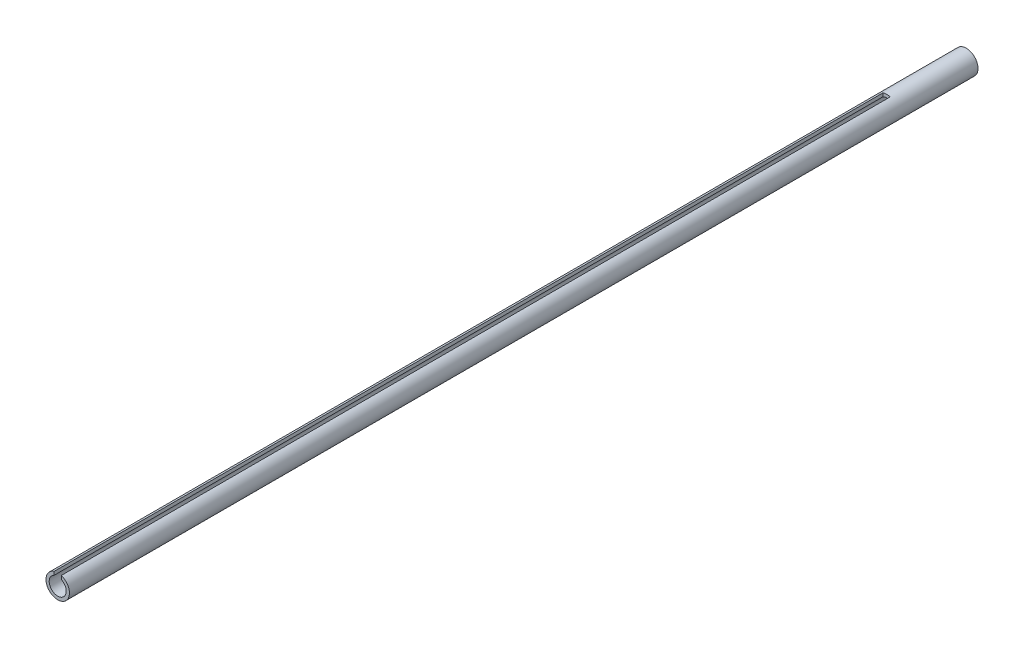
ISO-10303-21;
HEADER;
FILE_DESCRIPTION(('STEP AP214'),'2;1');
FILE_NAME('part.step','',(''),(''),'','','');
FILE_SCHEMA(('AUTOMOTIVE_DESIGN { 1 0 10303 214 1 1 1 1 }'));
ENDSEC;
DATA;
#1=APPLICATION_CONTEXT('core data for automotive mechanical design processes');
#2=APPLICATION_PROTOCOL_DEFINITION('international standard','automotive_design',2000,#1);
#3=PRODUCT_CONTEXT('',#1,'mechanical');
#4=PRODUCT('Part','Part','',(#3));
#5=PRODUCT_RELATED_PRODUCT_CATEGORY('part','',(#4));
#6=PRODUCT_DEFINITION_FORMATION('','',#4);
#7=PRODUCT_DEFINITION_CONTEXT('part definition',#1,'design');
#8=PRODUCT_DEFINITION('design','',#6,#7);
#9=PRODUCT_DEFINITION_SHAPE('','',#8);
#10=(LENGTH_UNIT() NAMED_UNIT(*) SI_UNIT(.MILLI.,.METRE.));
#11=(NAMED_UNIT(*) PLANE_ANGLE_UNIT() SI_UNIT($,.RADIAN.));
#12=(NAMED_UNIT(*) SI_UNIT($,.STERADIAN.) SOLID_ANGLE_UNIT());
#13=UNCERTAINTY_MEASURE_WITH_UNIT(LENGTH_MEASURE(1.E-05),#10,'distance_accuracy_value','');
#14=(GEOMETRIC_REPRESENTATION_CONTEXT(3) GLOBAL_UNCERTAINTY_ASSIGNED_CONTEXT((#13)) GLOBAL_UNIT_ASSIGNED_CONTEXT((#10,
#11,#12)) REPRESENTATION_CONTEXT('',''));
#15=CARTESIAN_POINT('',(0.,0.,0.));
#16=DIRECTION('',(0.,0.,1.));
#17=DIRECTION('',(1.,0.,0.));
#18=AXIS2_PLACEMENT_3D('',#15,#16,#17);
#19=CARTESIAN_POINT('',(0.,0.,57.));
#20=DIRECTION('',(0.,0.,1.));
#21=DIRECTION('',(1.,0.,0.));
#22=AXIS2_PLACEMENT_3D('',#19,#20,#21);
#23=PLANE('',#22);
#24=CARTESIAN_POINT('',(0.,0.,57.));
#25=DIRECTION('',(0.,0.,1.));
#26=DIRECTION('',(1.,0.,0.));
#27=AXIS2_PLACEMENT_3D('',#24,#25,#26);
#28=CIRCLE('',#27,0.535);
#29=CARTESIAN_POINT('',(-0.225,0.485386443980464,57.));
#30=VERTEX_POINT('',#29);
#31=CARTESIAN_POINT('',(0.225,0.485386443980464,57.));
#32=VERTEX_POINT('',#31);
#33=EDGE_CURVE('E134',#30,#32,#28,.T.);
#34=ORIENTED_EDGE('',*,*,#33,.F.);
#35=DIRECTION('',(0.,1.,0.));
#36=VECTOR('',#35,1.);
#37=CARTESIAN_POINT('',(-0.225,0.,57.));
#38=LINE('',#37,#36);
#39=CARTESIAN_POINT('',(-0.225,0.699714227381436,57.));
#40=VERTEX_POINT('',#39);
#41=EDGE_CURVE('E128',#30,#40,#38,.T.);
#42=ORIENTED_EDGE('',*,*,#41,.T.);
#43=CARTESIAN_POINT('',(0.,0.,57.));
#44=DIRECTION('',(0.,0.,1.));
#45=DIRECTION('',(1.,0.,0.));
#46=AXIS2_PLACEMENT_3D('',#43,#44,#45);
#47=CIRCLE('',#46,0.735);
#48=CARTESIAN_POINT('',(0.225,0.699714227381436,57.));
#49=VERTEX_POINT('',#48);
#50=EDGE_CURVE('E140',#40,#49,#47,.T.);
#51=ORIENTED_EDGE('',*,*,#50,.T.);
#52=DIRECTION('',(0.,-1.,0.));
#53=VECTOR('',#52,1.);
#54=CARTESIAN_POINT('',(0.225,0.,57.));
#55=LINE('',#54,#53);
#56=EDGE_CURVE('E123',#49,#32,#55,.T.);
#57=ORIENTED_EDGE('',*,*,#56,.T.);
#58=EDGE_LOOP('',(#34,#42,#51,#57));
#59=FACE_BOUND('',#58,.T.);
#60=ADVANCED_FACE('F32',(#59),#23,.T.);
#61=CARTESIAN_POINT('',(0.,0.,57.));
#62=DIRECTION('',(0.,0.,-1.));
#63=DIRECTION('',(-1.,0.,0.));
#64=AXIS2_PLACEMENT_3D('',#61,#62,#63);
#65=CYLINDRICAL_SURFACE('',#64,0.735);
#66=DIRECTION('',(0.,0.,-1.));
#67=VECTOR('',#66,1.);
#68=CARTESIAN_POINT('',(-0.500000000000123,-0.538725347463693,57.));
#69=LINE('',#68,#67);
#70=CARTESIAN_POINT('',(-0.5,-0.538725347463807,21.));
#71=VERTEX_POINT('',#70);
#72=CARTESIAN_POINT('',(-0.500000000000007,-0.538725347463801,23.));
#73=VERTEX_POINT('',#72);
#74=EDGE_CURVE('E105',#71,#73,#69,.F.);
#75=ORIENTED_EDGE('',*,*,#74,.T.);
#76=CARTESIAN_POINT('',(0.,0.,23.));
#77=DIRECTION('',(0.,0.,1.));
#78=DIRECTION('',(1.,0.,0.));
#79=AXIS2_PLACEMENT_3D('',#76,#77,#78);
#80=CIRCLE('',#79,0.735);
#81=CARTESIAN_POINT('',(0.5,-0.538725347463807,23.));
#82=VERTEX_POINT('',#81);
#83=EDGE_CURVE('E47',#73,#82,#80,.T.);
#84=ORIENTED_EDGE('',*,*,#83,.T.);
#85=DIRECTION('',(0.,0.,-1.));
#86=VECTOR('',#85,1.);
#87=CARTESIAN_POINT('',(0.500000000000006,-0.538725347463802,57.));
#88=LINE('',#87,#86);
#89=CARTESIAN_POINT('',(0.5,-0.538725347463802,21.));
#90=VERTEX_POINT('',#89);
#91=EDGE_CURVE('E98',#82,#90,#88,.T.);
#92=ORIENTED_EDGE('',*,*,#91,.T.);
#93=CARTESIAN_POINT('',(0.,0.,21.));
#94=DIRECTION('',(0.,0.,-1.));
#95=DIRECTION('',(-1.,0.,0.));
#96=AXIS2_PLACEMENT_3D('',#93,#94,#95);
#97=CIRCLE('',#96,0.735);
#98=EDGE_CURVE('E111',#90,#71,#97,.T.);
#99=ORIENTED_EDGE('',*,*,#98,.T.);
#100=EDGE_LOOP('',(#75,#84,#92,#99));
#101=FACE_BOUND('',#100,.T.);
#102=CARTESIAN_POINT('',(0.,0.,0.));
#103=DIRECTION('',(0.,0.,1.));
#104=DIRECTION('',(1.,0.,0.));
#105=AXIS2_PLACEMENT_3D('',#102,#103,#104);
#106=CIRCLE('',#105,0.735);
#107=CARTESIAN_POINT('',(0.735,0.,0.));
#108=VERTEX_POINT('',#107);
#109=EDGE_CURVE('E137',#108,#108,#106,.T.);
#110=ORIENTED_EDGE('',*,*,#109,.T.);
#111=EDGE_LOOP('',(#110));
#112=FACE_BOUND('',#111,.T.);
#113=DIRECTION('',(0.,0.,-1.));
#114=VECTOR('',#113,1.);
#115=CARTESIAN_POINT('',(0.225,0.699714227381436,57.));
#116=LINE('',#115,#114);
#117=CARTESIAN_POINT('',(0.225000000000006,0.699714227381434,5.));
#118=VERTEX_POINT('',#117);
#119=EDGE_CURVE('E126',#49,#118,#116,.T.);
#120=ORIENTED_EDGE('',*,*,#119,.F.);
#121=ORIENTED_EDGE('',*,*,#50,.F.);
#122=DIRECTION('',(0.,0.,-1.));
#123=VECTOR('',#122,1.);
#124=CARTESIAN_POINT('',(-0.225,0.699714227381436,57.));
#125=LINE('',#124,#123);
#126=CARTESIAN_POINT('',(-0.225000000000006,0.699714227381434,5.));
#127=VERTEX_POINT('',#126);
#128=EDGE_CURVE('E131',#127,#40,#125,.F.);
#129=ORIENTED_EDGE('',*,*,#128,.F.);
#130=CARTESIAN_POINT('',(0.,0.,5.));
#131=DIRECTION('',(0.,0.,1.));
#132=DIRECTION('',(1.,0.,0.));
#133=AXIS2_PLACEMENT_3D('',#130,#131,#132);
#134=CIRCLE('',#133,0.735);
#135=EDGE_CURVE('E121',#118,#127,#134,.T.);
#136=ORIENTED_EDGE('',*,*,#135,.F.);
#137=EDGE_LOOP('',(#120,#121,#129,#136));
#138=FACE_BOUND('',#137,.T.);
#139=ADVANCED_FACE('F34',(#101,#112,#138),#65,.T.);
#140=CARTESIAN_POINT('',(0.,0.,57.));
#141=DIRECTION('',(0.,0.,-1.));
#142=DIRECTION('',(-1.,0.,0.));
#143=AXIS2_PLACEMENT_3D('',#140,#141,#142);
#144=CYLINDRICAL_SURFACE('',#143,0.535);
#145=DIRECTION('',(0.,0.,-1.));
#146=VECTOR('',#145,1.);
#147=CARTESIAN_POINT('',(-0.500000000000123,-0.19032866310642,57.));
#148=LINE('',#147,#146);
#149=CARTESIAN_POINT('',(-0.5,-0.190328663106743,21.));
#150=VERTEX_POINT('',#149);
#151=CARTESIAN_POINT('',(-0.500000000000007,-0.190328663106725,23.));
#152=VERTEX_POINT('',#151);
#153=EDGE_CURVE('E11',#150,#152,#148,.F.);
#154=ORIENTED_EDGE('',*,*,#153,.F.);
#155=CARTESIAN_POINT('',(0.,0.,21.));
#156=DIRECTION('',(0.,0.,-1.));
#157=DIRECTION('',(-1.,0.,0.));
#158=AXIS2_PLACEMENT_3D('',#155,#156,#157);
#159=CIRCLE('',#158,0.535);
#160=CARTESIAN_POINT('',(0.5,-0.190328663106727,21.));
#161=VERTEX_POINT('',#160);
#162=EDGE_CURVE('E40',#161,#150,#159,.T.);
#163=ORIENTED_EDGE('',*,*,#162,.F.);
#164=DIRECTION('',(0.,0.,-1.));
#165=VECTOR('',#164,1.);
#166=CARTESIAN_POINT('',(0.500000000000006,-0.190328663106727,57.));
#167=LINE('',#166,#165);
#168=CARTESIAN_POINT('',(0.5,-0.190328663106742,23.));
#169=VERTEX_POINT('',#168);
#170=EDGE_CURVE('E156',#169,#161,#167,.T.);
#171=ORIENTED_EDGE('',*,*,#170,.F.);
#172=CARTESIAN_POINT('',(0.,0.,23.));
#173=DIRECTION('',(0.,0.,1.));
#174=DIRECTION('',(1.,0.,0.));
#175=AXIS2_PLACEMENT_3D('',#172,#173,#174);
#176=CIRCLE('',#175,0.535);
#177=EDGE_CURVE('E154',#152,#169,#176,.T.);
#178=ORIENTED_EDGE('',*,*,#177,.F.);
#179=EDGE_LOOP('',(#154,#163,#171,#178));
#180=FACE_BOUND('',#179,.T.);
#181=CARTESIAN_POINT('',(0.,0.,0.));
#182=DIRECTION('',(0.,0.,1.));
#183=DIRECTION('',(1.,0.,0.));
#184=AXIS2_PLACEMENT_3D('',#181,#182,#183);
#185=CIRCLE('',#184,0.535);
#186=CARTESIAN_POINT('',(0.535,0.,0.));
#187=VERTEX_POINT('',#186);
#188=EDGE_CURVE('E133',#187,#187,#185,.T.);
#189=ORIENTED_EDGE('',*,*,#188,.F.);
#190=EDGE_LOOP('',(#189));
#191=FACE_BOUND('',#190,.T.);
#192=CARTESIAN_POINT('',(0.,0.,5.));
#193=DIRECTION('',(0.,0.,1.));
#194=DIRECTION('',(1.,0.,0.));
#195=AXIS2_PLACEMENT_3D('',#192,#193,#194);
#196=CIRCLE('',#195,0.535);
#197=CARTESIAN_POINT('',(0.225000000000006,0.485386443980461,5.));
#198=VERTEX_POINT('',#197);
#199=CARTESIAN_POINT('',(-0.225000000000006,0.485386443980461,5.));
#200=VERTEX_POINT('',#199);
#201=EDGE_CURVE('E143',#198,#200,#196,.T.);
#202=ORIENTED_EDGE('',*,*,#201,.T.);
#203=DIRECTION('',(0.,0.,-1.));
#204=VECTOR('',#203,1.);
#205=CARTESIAN_POINT('',(-0.225,0.485386443980464,57.));
#206=LINE('',#205,#204);
#207=EDGE_CURVE('E151',#200,#30,#206,.F.);
#208=ORIENTED_EDGE('',*,*,#207,.T.);
#209=ORIENTED_EDGE('',*,*,#33,.T.);
#210=DIRECTION('',(0.,0.,-1.));
#211=VECTOR('',#210,1.);
#212=CARTESIAN_POINT('',(0.225,0.485386443980464,57.));
#213=LINE('',#212,#211);
#214=EDGE_CURVE('E148',#32,#198,#213,.T.);
#215=ORIENTED_EDGE('',*,*,#214,.T.);
#216=EDGE_LOOP('',(#202,#208,#209,#215));
#217=FACE_BOUND('',#216,.T.);
#218=ADVANCED_FACE('F166',(#180,#191,#217),#144,.F.);
#219=CARTESIAN_POINT('',(0.,0.,0.));
#220=DIRECTION('',(0.,0.,1.));
#221=DIRECTION('',(1.,0.,0.));
#222=AXIS2_PLACEMENT_3D('',#219,#220,#221);
#223=PLANE('',#222);
#224=ORIENTED_EDGE('',*,*,#109,.F.);
#225=EDGE_LOOP('',(#224));
#226=FACE_BOUND('',#225,.T.);
#227=ORIENTED_EDGE('',*,*,#188,.T.);
#228=EDGE_LOOP('',(#227));
#229=FACE_BOUND('',#228,.T.);
#230=ADVANCED_FACE('F189',(#226,#229),#223,.F.);
#231=CARTESIAN_POINT('',(-0.225000000000006,0.735,5.));
#232=DIRECTION('',(1.,0.,0.));
#233=DIRECTION('',(0.,0.,-1.));
#234=AXIS2_PLACEMENT_3D('',#231,#232,#233);
#235=PLANE('',#234);
#236=ORIENTED_EDGE('',*,*,#128,.T.);
#237=ORIENTED_EDGE('',*,*,#41,.F.);
#238=ORIENTED_EDGE('',*,*,#207,.F.);
#239=DIRECTION('',(0.,-1.,0.));
#240=VECTOR('',#239,1.);
#241=CARTESIAN_POINT('',(-0.225000000000006,0.735,5.));
#242=LINE('',#241,#240);
#243=EDGE_CURVE('E112',#127,#200,#242,.T.);
#244=ORIENTED_EDGE('',*,*,#243,.F.);
#245=EDGE_LOOP('',(#236,#237,#238,#244));
#246=FACE_BOUND('',#245,.T.);
#247=ADVANCED_FACE('F191',(#246),#235,.T.);
#248=CARTESIAN_POINT('',(0.225000000000006,0.735,5.));
#249=DIRECTION('',(-1.,0.,0.));
#250=DIRECTION('',(0.,0.,1.));
#251=AXIS2_PLACEMENT_3D('',#248,#249,#250);
#252=PLANE('',#251);
#253=ORIENTED_EDGE('',*,*,#119,.T.);
#254=DIRECTION('',(0.,-1.,0.));
#255=VECTOR('',#254,1.);
#256=CARTESIAN_POINT('',(0.225000000000006,0.735,5.));
#257=LINE('',#256,#255);
#258=EDGE_CURVE('E114',#118,#198,#257,.T.);
#259=ORIENTED_EDGE('',*,*,#258,.T.);
#260=ORIENTED_EDGE('',*,*,#214,.F.);
#261=ORIENTED_EDGE('',*,*,#56,.F.);
#262=EDGE_LOOP('',(#253,#259,#260,#261));
#263=FACE_BOUND('',#262,.T.);
#264=ADVANCED_FACE('F197',(#263),#252,.T.);
#265=CARTESIAN_POINT('',(-0.225000000000006,0.735,5.));
#266=DIRECTION('',(0.,0.,1.));
#267=DIRECTION('',(1.,0.,0.));
#268=AXIS2_PLACEMENT_3D('',#265,#266,#267);
#269=PLANE('',#268);
#270=ORIENTED_EDGE('',*,*,#135,.T.);
#271=ORIENTED_EDGE('',*,*,#243,.T.);
#272=ORIENTED_EDGE('',*,*,#201,.F.);
#273=ORIENTED_EDGE('',*,*,#258,.F.);
#274=EDGE_LOOP('',(#270,#271,#272,#273));
#275=FACE_BOUND('',#274,.T.);
#276=ADVANCED_FACE('F206',(#275),#269,.T.);
#277=CARTESIAN_POINT('',(-0.5,-0.735,21.));
#278=DIRECTION('',(-1.,0.,0.));
#279=DIRECTION('',(0.,0.,1.));
#280=AXIS2_PLACEMENT_3D('',#277,#278,#279);
#281=PLANE('',#280);
#282=DIRECTION('',(0.,1.,0.));
#283=VECTOR('',#282,1.);
#284=CARTESIAN_POINT('',(-0.5,-0.735,21.));
#285=LINE('',#284,#283);
#286=EDGE_CURVE('E99',#71,#150,#285,.T.);
#287=ORIENTED_EDGE('',*,*,#286,.T.);
#288=ORIENTED_EDGE('',*,*,#153,.T.);
#289=DIRECTION('',(0.,1.,0.));
#290=VECTOR('',#289,1.);
#291=CARTESIAN_POINT('',(-0.500000000000007,-0.735,23.));
#292=LINE('',#291,#290);
#293=EDGE_CURVE('E54',#73,#152,#292,.T.);
#294=ORIENTED_EDGE('',*,*,#293,.F.);
#295=ORIENTED_EDGE('',*,*,#74,.F.);
#296=EDGE_LOOP('',(#287,#288,#294,#295));
#297=FACE_BOUND('',#296,.T.);
#298=ADVANCED_FACE('F104',(#297),#281,.F.);
#299=CARTESIAN_POINT('',(-0.5,-0.735,21.));
#300=DIRECTION('',(0.,0.,-1.));
#301=DIRECTION('',(-1.,0.,0.));
#302=AXIS2_PLACEMENT_3D('',#299,#300,#301);
#303=PLANE('',#302);
#304=DIRECTION('',(0.,1.,0.));
#305=VECTOR('',#304,1.);
#306=CARTESIAN_POINT('',(0.5,-0.735,21.));
#307=LINE('',#306,#305);
#308=EDGE_CURVE('E162',#90,#161,#307,.T.);
#309=ORIENTED_EDGE('',*,*,#308,.T.);
#310=ORIENTED_EDGE('',*,*,#162,.T.);
#311=ORIENTED_EDGE('',*,*,#286,.F.);
#312=ORIENTED_EDGE('',*,*,#98,.F.);
#313=EDGE_LOOP('',(#309,#310,#311,#312));
#314=FACE_BOUND('',#313,.T.);
#315=ADVANCED_FACE('F160',(#314),#303,.F.);
#316=CARTESIAN_POINT('',(0.5,-0.735,21.));
#317=DIRECTION('',(1.,0.,0.));
#318=DIRECTION('',(0.,0.,-1.));
#319=AXIS2_PLACEMENT_3D('',#316,#317,#318);
#320=PLANE('',#319);
#321=DIRECTION('',(0.,1.,0.));
#322=VECTOR('',#321,1.);
#323=CARTESIAN_POINT('',(0.5,-0.735,23.));
#324=LINE('',#323,#322);
#325=EDGE_CURVE('E96',#82,#169,#324,.T.);
#326=ORIENTED_EDGE('',*,*,#325,.T.);
#327=ORIENTED_EDGE('',*,*,#170,.T.);
#328=ORIENTED_EDGE('',*,*,#308,.F.);
#329=ORIENTED_EDGE('',*,*,#91,.F.);
#330=EDGE_LOOP('',(#326,#327,#328,#329));
#331=FACE_BOUND('',#330,.T.);
#332=ADVANCED_FACE('F169',(#331),#320,.F.);
#333=CARTESIAN_POINT('',(-0.500000000000007,-0.735,23.));
#334=DIRECTION('',(0.,0.,1.));
#335=DIRECTION('',(1.,0.,0.));
#336=AXIS2_PLACEMENT_3D('',#333,#334,#335);
#337=PLANE('',#336);
#338=ORIENTED_EDGE('',*,*,#293,.T.);
#339=ORIENTED_EDGE('',*,*,#177,.T.);
#340=ORIENTED_EDGE('',*,*,#325,.F.);
#341=ORIENTED_EDGE('',*,*,#83,.F.);
#342=EDGE_LOOP('',(#338,#339,#340,#341));
#343=FACE_BOUND('',#342,.T.);
#344=ADVANCED_FACE('F94',(#343),#337,.F.);
#345=CLOSED_SHELL('',(#60,#139,#218,#230,#247,#264,#276,#298,#315,#332,#344));
#346=MANIFOLD_SOLID_BREP('B2',#345);
#347=ADVANCED_BREP_SHAPE_REPRESENTATION('',(#18,#346),#14);
#348=SHAPE_DEFINITION_REPRESENTATION(#9,#347);
ENDSEC;
END-ISO-10303-21;
